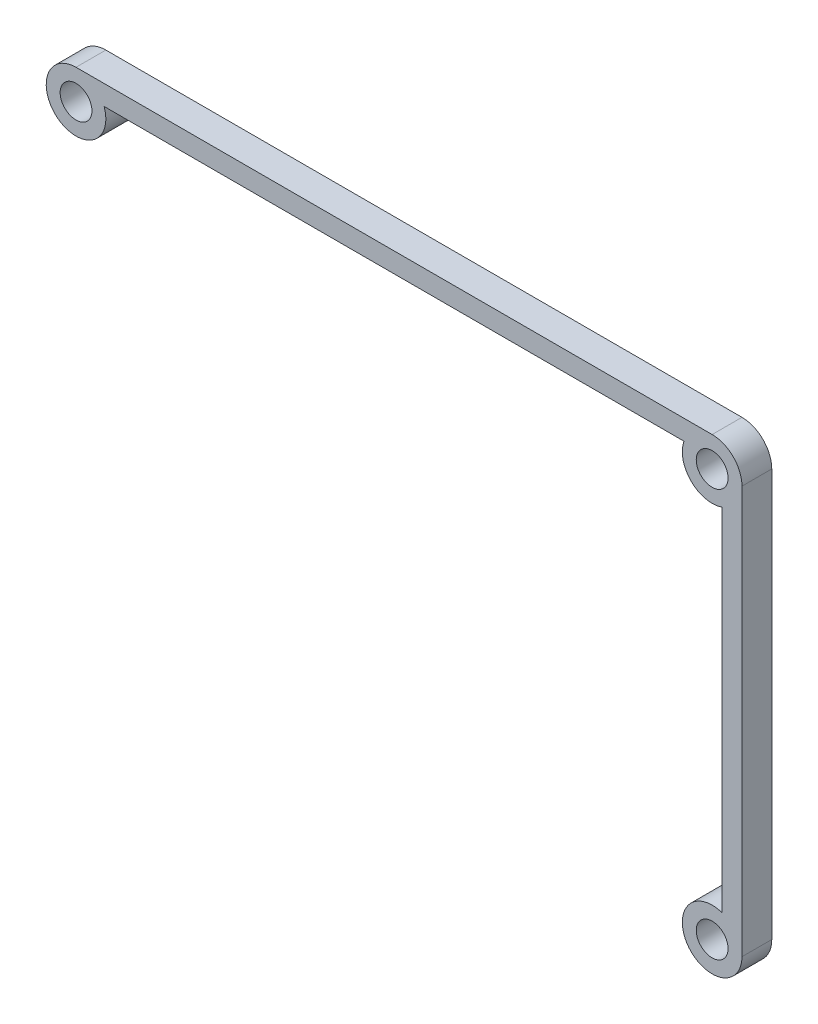
ISO-10303-21;
HEADER;
FILE_DESCRIPTION(('STEP AP214'),'2;1');
FILE_NAME('part.step','',(''),(''),'','','');
FILE_SCHEMA(('AUTOMOTIVE_DESIGN { 1 0 10303 214 1 1 1 1 }'));
ENDSEC;
DATA;
#1=APPLICATION_CONTEXT('core data for automotive mechanical design processes');
#2=APPLICATION_PROTOCOL_DEFINITION('international standard','automotive_design',2000,#1);
#3=PRODUCT_CONTEXT('',#1,'mechanical');
#4=PRODUCT('Part','Part','',(#3));
#5=PRODUCT_RELATED_PRODUCT_CATEGORY('part','',(#4));
#6=PRODUCT_DEFINITION_FORMATION('','',#4);
#7=PRODUCT_DEFINITION_CONTEXT('part definition',#1,'design');
#8=PRODUCT_DEFINITION('design','',#6,#7);
#9=PRODUCT_DEFINITION_SHAPE('','',#8);
#10=(LENGTH_UNIT() NAMED_UNIT(*) SI_UNIT(.MILLI.,.METRE.));
#11=(NAMED_UNIT(*) PLANE_ANGLE_UNIT() SI_UNIT($,.RADIAN.));
#12=(NAMED_UNIT(*) SI_UNIT($,.STERADIAN.) SOLID_ANGLE_UNIT());
#13=UNCERTAINTY_MEASURE_WITH_UNIT(LENGTH_MEASURE(1.E-05),#10,'distance_accuracy_value','');
#14=(GEOMETRIC_REPRESENTATION_CONTEXT(3) GLOBAL_UNCERTAINTY_ASSIGNED_CONTEXT((#13)) GLOBAL_UNIT_ASSIGNED_CONTEXT((#10,
#11,#12)) REPRESENTATION_CONTEXT('',''));
#15=CARTESIAN_POINT('',(0.,0.,0.));
#16=DIRECTION('',(0.,0.,1.));
#17=DIRECTION('',(1.,0.,0.));
#18=AXIS2_PLACEMENT_3D('',#15,#16,#17);
#19=CARTESIAN_POINT('',(32.,20.5,3.));
#20=DIRECTION('',(0.,0.,-1.));
#21=DIRECTION('',(-1.,0.,0.));
#22=AXIS2_PLACEMENT_3D('',#19,#20,#21);
#23=PLANE('',#22);
#24=CARTESIAN_POINT('',(32.,20.5,3.));
#25=DIRECTION('',(0.,0.,1.));
#26=DIRECTION('',(-1.,0.,0.));
#27=AXIS2_PLACEMENT_3D('',#24,#25,#26);
#28=CIRCLE('',#27,3.);
#29=CARTESIAN_POINT('',(35.,20.5,3.));
#30=VERTEX_POINT('',#29);
#31=CARTESIAN_POINT('',(32.,23.5,3.));
#32=VERTEX_POINT('',#31);
#33=EDGE_CURVE('E145',#30,#32,#28,.T.);
#34=ORIENTED_EDGE('',*,*,#33,.T.);
#35=DIRECTION('',(-1.,0.,0.));
#36=VECTOR('',#35,1.);
#37=CARTESIAN_POINT('',(-32.,23.5,3.));
#38=LINE('',#37,#36);
#39=CARTESIAN_POINT('',(-32.,23.5,3.));
#40=VERTEX_POINT('',#39);
#41=EDGE_CURVE('E93',#32,#40,#38,.T.);
#42=ORIENTED_EDGE('',*,*,#41,.T.);
#43=CARTESIAN_POINT('',(-32.,20.5,3.));
#44=DIRECTION('',(0.,0.,1.));
#45=DIRECTION('',(1.,0.,0.));
#46=AXIS2_PLACEMENT_3D('',#43,#44,#45);
#47=CIRCLE('',#46,3.);
#48=CARTESIAN_POINT('',(-29.1715728752538,21.5,3.));
#49=VERTEX_POINT('',#48);
#50=EDGE_CURVE('E160',#40,#49,#47,.T.);
#51=ORIENTED_EDGE('',*,*,#50,.T.);
#52=DIRECTION('',(1.,0.,0.));
#53=VECTOR('',#52,1.);
#54=CARTESIAN_POINT('',(-29.1715728752538,21.5,3.));
#55=LINE('',#54,#53);
#56=CARTESIAN_POINT('',(29.1715728752538,21.5,3.));
#57=VERTEX_POINT('',#56);
#58=EDGE_CURVE('E173',#49,#57,#55,.T.);
#59=ORIENTED_EDGE('',*,*,#58,.T.);
#60=CARTESIAN_POINT('',(32.,20.5,3.));
#61=DIRECTION('',(0.,0.,1.));
#62=DIRECTION('',(-1.,0.,0.));
#63=AXIS2_PLACEMENT_3D('',#60,#61,#62);
#64=CIRCLE('',#63,3.00000000000001);
#65=CARTESIAN_POINT('',(33.,17.6715728752538,3.));
#66=VERTEX_POINT('',#65);
#67=EDGE_CURVE('E112',#57,#66,#64,.T.);
#68=ORIENTED_EDGE('',*,*,#67,.T.);
#69=DIRECTION('',(0.,-1.,0.));
#70=VECTOR('',#69,1.);
#71=CARTESIAN_POINT('',(33.,17.6715728752538,3.));
#72=LINE('',#71,#70);
#73=CARTESIAN_POINT('',(33.,-17.6715728752538,3.));
#74=VERTEX_POINT('',#73);
#75=EDGE_CURVE('E106',#66,#74,#72,.T.);
#76=ORIENTED_EDGE('',*,*,#75,.T.);
#77=CARTESIAN_POINT('',(32.,-20.5,3.));
#78=DIRECTION('',(0.,0.,1.));
#79=DIRECTION('',(1.,0.,0.));
#80=AXIS2_PLACEMENT_3D('',#77,#78,#79);
#81=CIRCLE('',#80,3.);
#82=CARTESIAN_POINT('',(35.,-20.5,3.));
#83=VERTEX_POINT('',#82);
#84=EDGE_CURVE('E110',#74,#83,#81,.T.);
#85=ORIENTED_EDGE('',*,*,#84,.T.);
#86=DIRECTION('',(0.,1.,0.));
#87=VECTOR('',#86,1.);
#88=CARTESIAN_POINT('',(35.,20.5,3.));
#89=LINE('',#88,#87);
#90=EDGE_CURVE('E50',#83,#30,#89,.T.);
#91=ORIENTED_EDGE('',*,*,#90,.T.);
#92=EDGE_LOOP('',(#34,#42,#51,#59,#68,#76,#85,#91));
#93=FACE_BOUND('',#92,.T.);
#94=CARTESIAN_POINT('',(-32.,20.5,3.));
#95=DIRECTION('',(0.,0.,1.));
#96=DIRECTION('',(1.,0.,0.));
#97=AXIS2_PLACEMENT_3D('',#94,#95,#96);
#98=CIRCLE('',#97,1.6);
#99=CARTESIAN_POINT('',(-30.4,20.5,3.));
#100=VERTEX_POINT('',#99);
#101=EDGE_CURVE('E134',#100,#100,#98,.T.);
#102=ORIENTED_EDGE('',*,*,#101,.F.);
#103=EDGE_LOOP('',(#102));
#104=FACE_BOUND('',#103,.T.);
#105=CARTESIAN_POINT('',(32.,20.5,3.));
#106=DIRECTION('',(0.,0.,1.));
#107=DIRECTION('',(-1.,0.,0.));
#108=AXIS2_PLACEMENT_3D('',#105,#106,#107);
#109=CIRCLE('',#108,1.6);
#110=CARTESIAN_POINT('',(30.4,20.5,3.));
#111=VERTEX_POINT('',#110);
#112=EDGE_CURVE('E182',#111,#111,#109,.T.);
#113=ORIENTED_EDGE('',*,*,#112,.F.);
#114=EDGE_LOOP('',(#113));
#115=FACE_BOUND('',#114,.T.);
#116=CARTESIAN_POINT('',(32.,-20.5,3.));
#117=DIRECTION('',(0.,0.,1.));
#118=DIRECTION('',(1.,0.,0.));
#119=AXIS2_PLACEMENT_3D('',#116,#117,#118);
#120=CIRCLE('',#119,1.6);
#121=CARTESIAN_POINT('',(33.6,-20.5,3.));
#122=VERTEX_POINT('',#121);
#123=EDGE_CURVE('E188',#122,#122,#120,.T.);
#124=ORIENTED_EDGE('',*,*,#123,.F.);
#125=EDGE_LOOP('',(#124));
#126=FACE_BOUND('',#125,.T.);
#127=ADVANCED_FACE('F33',(#93,#104,#115,#126),#23,.F.);
#128=CARTESIAN_POINT('',(32.,20.5,0.));
#129=DIRECTION('',(0.,0.,-1.));
#130=DIRECTION('',(-1.,0.,0.));
#131=AXIS2_PLACEMENT_3D('',#128,#129,#130);
#132=PLANE('',#131);
#133=CARTESIAN_POINT('',(32.,20.5,0.));
#134=DIRECTION('',(0.,0.,1.));
#135=DIRECTION('',(-1.,0.,0.));
#136=AXIS2_PLACEMENT_3D('',#133,#134,#135);
#137=CIRCLE('',#136,1.6);
#138=CARTESIAN_POINT('',(30.4,20.5,0.));
#139=VERTEX_POINT('',#138);
#140=EDGE_CURVE('E185',#139,#139,#137,.T.);
#141=ORIENTED_EDGE('',*,*,#140,.T.);
#142=EDGE_LOOP('',(#141));
#143=FACE_BOUND('',#142,.T.);
#144=CARTESIAN_POINT('',(32.,20.5,0.));
#145=DIRECTION('',(0.,0.,1.));
#146=DIRECTION('',(-1.,0.,0.));
#147=AXIS2_PLACEMENT_3D('',#144,#145,#146);
#148=CIRCLE('',#147,3.);
#149=CARTESIAN_POINT('',(35.,20.5,0.));
#150=VERTEX_POINT('',#149);
#151=CARTESIAN_POINT('',(32.,23.5,0.));
#152=VERTEX_POINT('',#151);
#153=EDGE_CURVE('E130',#150,#152,#148,.T.);
#154=ORIENTED_EDGE('',*,*,#153,.F.);
#155=DIRECTION('',(0.,1.,0.));
#156=VECTOR('',#155,1.);
#157=CARTESIAN_POINT('',(35.,20.5,0.));
#158=LINE('',#157,#156);
#159=CARTESIAN_POINT('',(35.,-20.5,0.));
#160=VERTEX_POINT('',#159);
#161=EDGE_CURVE('E85',#160,#150,#158,.T.);
#162=ORIENTED_EDGE('',*,*,#161,.F.);
#163=CARTESIAN_POINT('',(32.,-20.5,0.));
#164=DIRECTION('',(0.,0.,1.));
#165=DIRECTION('',(1.,0.,0.));
#166=AXIS2_PLACEMENT_3D('',#163,#164,#165);
#167=CIRCLE('',#166,3.);
#168=CARTESIAN_POINT('',(33.,-17.6715728752538,0.));
#169=VERTEX_POINT('',#168);
#170=EDGE_CURVE('E79',#169,#160,#167,.T.);
#171=ORIENTED_EDGE('',*,*,#170,.F.);
#172=DIRECTION('',(0.,-1.,0.));
#173=VECTOR('',#172,1.);
#174=CARTESIAN_POINT('',(33.,17.6715728752538,0.));
#175=LINE('',#174,#173);
#176=CARTESIAN_POINT('',(33.,17.6715728752538,0.));
#177=VERTEX_POINT('',#176);
#178=EDGE_CURVE('E120',#177,#169,#175,.T.);
#179=ORIENTED_EDGE('',*,*,#178,.F.);
#180=CARTESIAN_POINT('',(32.,20.5,0.));
#181=DIRECTION('',(0.,0.,1.));
#182=DIRECTION('',(-1.,0.,0.));
#183=AXIS2_PLACEMENT_3D('',#180,#181,#182);
#184=CIRCLE('',#183,3.00000000000001);
#185=CARTESIAN_POINT('',(29.1715728752538,21.5,0.));
#186=VERTEX_POINT('',#185);
#187=EDGE_CURVE('E140',#186,#177,#184,.T.);
#188=ORIENTED_EDGE('',*,*,#187,.F.);
#189=DIRECTION('',(1.,0.,0.));
#190=VECTOR('',#189,1.);
#191=CARTESIAN_POINT('',(-29.1715728752538,21.5,0.));
#192=LINE('',#191,#190);
#193=CARTESIAN_POINT('',(-29.1715728752538,21.5,0.));
#194=VERTEX_POINT('',#193);
#195=EDGE_CURVE('E138',#194,#186,#192,.T.);
#196=ORIENTED_EDGE('',*,*,#195,.F.);
#197=CARTESIAN_POINT('',(-32.,20.5,0.));
#198=DIRECTION('',(0.,0.,1.));
#199=DIRECTION('',(1.,0.,0.));
#200=AXIS2_PLACEMENT_3D('',#197,#198,#199);
#201=CIRCLE('',#200,3.);
#202=CARTESIAN_POINT('',(-32.,23.5,0.));
#203=VERTEX_POINT('',#202);
#204=EDGE_CURVE('E136',#203,#194,#201,.T.);
#205=ORIENTED_EDGE('',*,*,#204,.F.);
#206=DIRECTION('',(-1.,0.,0.));
#207=VECTOR('',#206,1.);
#208=CARTESIAN_POINT('',(-32.,23.5,0.));
#209=LINE('',#208,#207);
#210=EDGE_CURVE('E133',#152,#203,#209,.T.);
#211=ORIENTED_EDGE('',*,*,#210,.F.);
#212=EDGE_LOOP('',(#154,#162,#171,#179,#188,#196,#205,#211));
#213=FACE_BOUND('',#212,.T.);
#214=CARTESIAN_POINT('',(-32.,20.5,0.));
#215=DIRECTION('',(0.,0.,1.));
#216=DIRECTION('',(1.,0.,0.));
#217=AXIS2_PLACEMENT_3D('',#214,#215,#216);
#218=CIRCLE('',#217,1.6);
#219=CARTESIAN_POINT('',(-30.4,20.5,0.));
#220=VERTEX_POINT('',#219);
#221=EDGE_CURVE('E179',#220,#220,#218,.T.);
#222=ORIENTED_EDGE('',*,*,#221,.T.);
#223=EDGE_LOOP('',(#222));
#224=FACE_BOUND('',#223,.T.);
#225=CARTESIAN_POINT('',(32.,-20.5,0.));
#226=DIRECTION('',(0.,0.,1.));
#227=DIRECTION('',(1.,0.,0.));
#228=AXIS2_PLACEMENT_3D('',#225,#226,#227);
#229=CIRCLE('',#228,1.6);
#230=CARTESIAN_POINT('',(33.6,-20.5,0.));
#231=VERTEX_POINT('',#230);
#232=EDGE_CURVE('E191',#231,#231,#229,.T.);
#233=ORIENTED_EDGE('',*,*,#232,.T.);
#234=EDGE_LOOP('',(#233));
#235=FACE_BOUND('',#234,.T.);
#236=ADVANCED_FACE('F164',(#143,#213,#224,#235),#132,.T.);
#237=CARTESIAN_POINT('',(32.,20.5,3.));
#238=DIRECTION('',(0.,0.,-1.));
#239=DIRECTION('',(-1.,0.,0.));
#240=AXIS2_PLACEMENT_3D('',#237,#238,#239);
#241=CYLINDRICAL_SURFACE('',#240,3.);
#242=ORIENTED_EDGE('',*,*,#153,.T.);
#243=DIRECTION('',(0.,0.,-1.));
#244=VECTOR('',#243,1.);
#245=CARTESIAN_POINT('',(32.,23.5,3.));
#246=LINE('',#245,#244);
#247=EDGE_CURVE('E11',#32,#152,#246,.T.);
#248=ORIENTED_EDGE('',*,*,#247,.F.);
#249=ORIENTED_EDGE('',*,*,#33,.F.);
#250=DIRECTION('',(0.,0.,-1.));
#251=VECTOR('',#250,1.);
#252=CARTESIAN_POINT('',(35.,20.5,3.));
#253=LINE('',#252,#251);
#254=EDGE_CURVE('E126',#30,#150,#253,.T.);
#255=ORIENTED_EDGE('',*,*,#254,.T.);
#256=EDGE_LOOP('',(#242,#248,#249,#255));
#257=FACE_BOUND('',#256,.T.);
#258=ADVANCED_FACE('F35',(#257),#241,.T.);
#259=CARTESIAN_POINT('',(-32.,23.5,3.));
#260=DIRECTION('',(0.,-1.,0.));
#261=DIRECTION('',(1.,0.,0.));
#262=AXIS2_PLACEMENT_3D('',#259,#260,#261);
#263=PLANE('',#262);
#264=ORIENTED_EDGE('',*,*,#210,.T.);
#265=DIRECTION('',(0.,0.,-1.));
#266=VECTOR('',#265,1.);
#267=CARTESIAN_POINT('',(-32.,23.5,3.));
#268=LINE('',#267,#266);
#269=EDGE_CURVE('E42',#40,#203,#268,.T.);
#270=ORIENTED_EDGE('',*,*,#269,.F.);
#271=ORIENTED_EDGE('',*,*,#41,.F.);
#272=ORIENTED_EDGE('',*,*,#247,.T.);
#273=EDGE_LOOP('',(#264,#270,#271,#272));
#274=FACE_BOUND('',#273,.T.);
#275=ADVANCED_FACE('F223',(#274),#263,.F.);
#276=CARTESIAN_POINT('',(-32.,20.5,3.));
#277=DIRECTION('',(0.,0.,-1.));
#278=DIRECTION('',(-1.,0.,0.));
#279=AXIS2_PLACEMENT_3D('',#276,#277,#278);
#280=CYLINDRICAL_SURFACE('',#279,3.);
#281=ORIENTED_EDGE('',*,*,#204,.T.);
#282=DIRECTION('',(0.,0.,-1.));
#283=VECTOR('',#282,1.);
#284=CARTESIAN_POINT('',(-29.1715728752538,21.5,3.));
#285=LINE('',#284,#283);
#286=EDGE_CURVE('E152',#49,#194,#285,.T.);
#287=ORIENTED_EDGE('',*,*,#286,.F.);
#288=ORIENTED_EDGE('',*,*,#50,.F.);
#289=ORIENTED_EDGE('',*,*,#269,.T.);
#290=EDGE_LOOP('',(#281,#287,#288,#289));
#291=FACE_BOUND('',#290,.T.);
#292=ADVANCED_FACE('F158',(#291),#280,.T.);
#293=CARTESIAN_POINT('',(-29.1715728752538,21.5,3.));
#294=DIRECTION('',(0.,1.,0.));
#295=DIRECTION('',(-1.,0.,0.));
#296=AXIS2_PLACEMENT_3D('',#293,#294,#295);
#297=PLANE('',#296);
#298=ORIENTED_EDGE('',*,*,#195,.T.);
#299=DIRECTION('',(0.,0.,-1.));
#300=VECTOR('',#299,1.);
#301=CARTESIAN_POINT('',(29.1715728752538,21.5,3.));
#302=LINE('',#301,#300);
#303=EDGE_CURVE('E149',#57,#186,#302,.T.);
#304=ORIENTED_EDGE('',*,*,#303,.F.);
#305=ORIENTED_EDGE('',*,*,#58,.F.);
#306=ORIENTED_EDGE('',*,*,#286,.T.);
#307=EDGE_LOOP('',(#298,#304,#305,#306));
#308=FACE_BOUND('',#307,.T.);
#309=ADVANCED_FACE('F169',(#308),#297,.F.);
#310=CARTESIAN_POINT('',(32.,20.5,3.));
#311=DIRECTION('',(0.,0.,-1.));
#312=DIRECTION('',(-1.,0.,0.));
#313=AXIS2_PLACEMENT_3D('',#310,#311,#312);
#314=CYLINDRICAL_SURFACE('',#313,3.00000000000001);
#315=ORIENTED_EDGE('',*,*,#187,.T.);
#316=DIRECTION('',(0.,0.,-1.));
#317=VECTOR('',#316,1.);
#318=CARTESIAN_POINT('',(33.,17.6715728752538,3.));
#319=LINE('',#318,#317);
#320=EDGE_CURVE('E121',#66,#177,#319,.T.);
#321=ORIENTED_EDGE('',*,*,#320,.F.);
#322=ORIENTED_EDGE('',*,*,#67,.F.);
#323=ORIENTED_EDGE('',*,*,#303,.T.);
#324=EDGE_LOOP('',(#315,#321,#322,#323));
#325=FACE_BOUND('',#324,.T.);
#326=ADVANCED_FACE('F172',(#325),#314,.T.);
#327=CARTESIAN_POINT('',(33.,17.6715728752538,3.));
#328=DIRECTION('',(1.,0.,0.));
#329=DIRECTION('',(0.,0.,-1.));
#330=AXIS2_PLACEMENT_3D('',#327,#328,#329);
#331=PLANE('',#330);
#332=ORIENTED_EDGE('',*,*,#178,.T.);
#333=DIRECTION('',(0.,0.,-1.));
#334=VECTOR('',#333,1.);
#335=CARTESIAN_POINT('',(33.,-17.6715728752538,3.));
#336=LINE('',#335,#334);
#337=EDGE_CURVE('E117',#74,#169,#336,.T.);
#338=ORIENTED_EDGE('',*,*,#337,.F.);
#339=ORIENTED_EDGE('',*,*,#75,.F.);
#340=ORIENTED_EDGE('',*,*,#320,.T.);
#341=EDGE_LOOP('',(#332,#338,#339,#340));
#342=FACE_BOUND('',#341,.T.);
#343=ADVANCED_FACE('F118',(#342),#331,.F.);
#344=CARTESIAN_POINT('',(32.,-20.5,3.));
#345=DIRECTION('',(0.,0.,-1.));
#346=DIRECTION('',(-1.,0.,0.));
#347=AXIS2_PLACEMENT_3D('',#344,#345,#346);
#348=CYLINDRICAL_SURFACE('',#347,3.);
#349=ORIENTED_EDGE('',*,*,#170,.T.);
#350=DIRECTION('',(0.,0.,-1.));
#351=VECTOR('',#350,1.);
#352=CARTESIAN_POINT('',(35.,-20.5,3.));
#353=LINE('',#352,#351);
#354=EDGE_CURVE('E122',#83,#160,#353,.T.);
#355=ORIENTED_EDGE('',*,*,#354,.F.);
#356=ORIENTED_EDGE('',*,*,#84,.F.);
#357=ORIENTED_EDGE('',*,*,#337,.T.);
#358=EDGE_LOOP('',(#349,#355,#356,#357));
#359=FACE_BOUND('',#358,.T.);
#360=ADVANCED_FACE('F124',(#359),#348,.T.);
#361=CARTESIAN_POINT('',(35.,20.5,3.));
#362=DIRECTION('',(-1.,0.,0.));
#363=DIRECTION('',(0.,0.,1.));
#364=AXIS2_PLACEMENT_3D('',#361,#362,#363);
#365=PLANE('',#364);
#366=ORIENTED_EDGE('',*,*,#161,.T.);
#367=ORIENTED_EDGE('',*,*,#254,.F.);
#368=ORIENTED_EDGE('',*,*,#90,.F.);
#369=ORIENTED_EDGE('',*,*,#354,.T.);
#370=EDGE_LOOP('',(#366,#367,#368,#369));
#371=FACE_BOUND('',#370,.T.);
#372=ADVANCED_FACE('F211',(#371),#365,.F.);
#373=CARTESIAN_POINT('',(-32.,20.5,3.));
#374=DIRECTION('',(0.,0.,-1.));
#375=DIRECTION('',(-1.,0.,0.));
#376=AXIS2_PLACEMENT_3D('',#373,#374,#375);
#377=CYLINDRICAL_SURFACE('',#376,1.6);
#378=ORIENTED_EDGE('',*,*,#101,.T.);
#379=EDGE_LOOP('',(#378));
#380=FACE_BOUND('',#379,.T.);
#381=ORIENTED_EDGE('',*,*,#221,.F.);
#382=EDGE_LOOP('',(#381));
#383=FACE_BOUND('',#382,.T.);
#384=ADVANCED_FACE('F208',(#380,#383),#377,.F.);
#385=CARTESIAN_POINT('',(32.,20.5,3.));
#386=DIRECTION('',(0.,0.,-1.));
#387=DIRECTION('',(-1.,0.,0.));
#388=AXIS2_PLACEMENT_3D('',#385,#386,#387);
#389=CYLINDRICAL_SURFACE('',#388,1.6);
#390=ORIENTED_EDGE('',*,*,#112,.T.);
#391=EDGE_LOOP('',(#390));
#392=FACE_BOUND('',#391,.T.);
#393=ORIENTED_EDGE('',*,*,#140,.F.);
#394=EDGE_LOOP('',(#393));
#395=FACE_BOUND('',#394,.T.);
#396=ADVANCED_FACE('F287',(#392,#395),#389,.F.);
#397=CARTESIAN_POINT('',(32.,-20.5,3.));
#398=DIRECTION('',(0.,0.,-1.));
#399=DIRECTION('',(-1.,0.,0.));
#400=AXIS2_PLACEMENT_3D('',#397,#398,#399);
#401=CYLINDRICAL_SURFACE('',#400,1.6);
#402=ORIENTED_EDGE('',*,*,#123,.T.);
#403=EDGE_LOOP('',(#402));
#404=FACE_BOUND('',#403,.T.);
#405=ORIENTED_EDGE('',*,*,#232,.F.);
#406=EDGE_LOOP('',(#405));
#407=FACE_BOUND('',#406,.T.);
#408=ADVANCED_FACE('F197',(#404,#407),#401,.F.);
#409=CLOSED_SHELL('',(#127,#236,#258,#275,#292,#309,#326,#343,#360,#372,#384,#396,#408));
#410=MANIFOLD_SOLID_BREP('B2',#409);
#411=ADVANCED_BREP_SHAPE_REPRESENTATION('',(#18,#410),#14);
#412=SHAPE_DEFINITION_REPRESENTATION(#9,#411);
ENDSEC;
END-ISO-10303-21;
